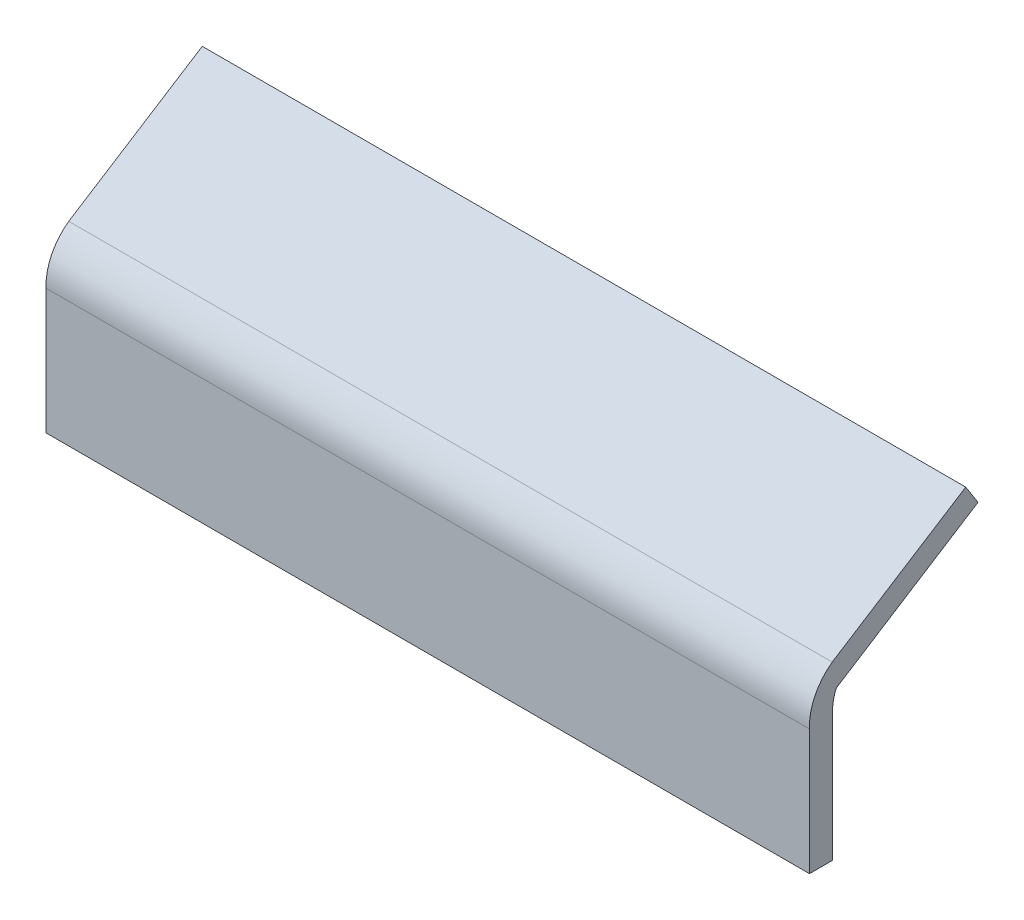
ISO-10303-21;
HEADER;
FILE_DESCRIPTION(('STEP AP214'),'2;1');
FILE_NAME('part.step','',(''),(''),'','','');
FILE_SCHEMA(('AUTOMOTIVE_DESIGN { 1 0 10303 214 1 1 1 1 }'));
ENDSEC;
DATA;
#1=APPLICATION_CONTEXT('core data for automotive mechanical design processes');
#2=APPLICATION_PROTOCOL_DEFINITION('international standard','automotive_design',2000,#1);
#3=PRODUCT_CONTEXT('',#1,'mechanical');
#4=PRODUCT('Part','Part','',(#3));
#5=PRODUCT_RELATED_PRODUCT_CATEGORY('part','',(#4));
#6=PRODUCT_DEFINITION_FORMATION('','',#4);
#7=PRODUCT_DEFINITION_CONTEXT('part definition',#1,'design');
#8=PRODUCT_DEFINITION('design','',#6,#7);
#9=PRODUCT_DEFINITION_SHAPE('','',#8);
#10=(LENGTH_UNIT() NAMED_UNIT(*) SI_UNIT(.MILLI.,.METRE.));
#11=(NAMED_UNIT(*) PLANE_ANGLE_UNIT() SI_UNIT($,.RADIAN.));
#12=(NAMED_UNIT(*) SI_UNIT($,.STERADIAN.) SOLID_ANGLE_UNIT());
#13=UNCERTAINTY_MEASURE_WITH_UNIT(LENGTH_MEASURE(1.E-05),#10,'distance_accuracy_value','');
#14=(GEOMETRIC_REPRESENTATION_CONTEXT(3) GLOBAL_UNCERTAINTY_ASSIGNED_CONTEXT((#13)) GLOBAL_UNIT_ASSIGNED_CONTEXT((#10,
#11,#12)) REPRESENTATION_CONTEXT('',''));
#15=CARTESIAN_POINT('',(0.,0.,0.));
#16=DIRECTION('',(0.,0.,1.));
#17=DIRECTION('',(1.,0.,0.));
#18=AXIS2_PLACEMENT_3D('',#15,#16,#17);
#19=CARTESIAN_POINT('',(-557.5,91.4999999999999,33.45));
#20=DIRECTION('',(1.,0.,0.));
#21=DIRECTION('',(0.,0.,-1.));
#22=AXIS2_PLACEMENT_3D('',#19,#20,#21);
#23=PLANE('',#22);
#24=DIRECTION('',(0.,-1.,0.));
#25=VECTOR('',#24,1.);
#26=CARTESIAN_POINT('',(-557.5,91.4999999999999,0.));
#27=LINE('',#26,#25);
#28=CARTESIAN_POINT('',(-557.5,91.4999999999999,0.));
#29=VERTEX_POINT('',#28);
#30=CARTESIAN_POINT('',(-557.5,-91.5000000000001,0.));
#31=VERTEX_POINT('',#30);
#32=EDGE_CURVE('E82',#29,#31,#27,.T.);
#33=ORIENTED_EDGE('',*,*,#32,.T.);
#34=DIRECTION('',(0.,0.,-1.));
#35=VECTOR('',#34,1.);
#36=CARTESIAN_POINT('',(-557.5,-91.5000000000001,33.45));
#37=LINE('',#36,#35);
#38=CARTESIAN_POINT('',(-557.5,-91.5000000000001,33.45));
#39=VERTEX_POINT('',#38);
#40=EDGE_CURVE('E11',#39,#31,#37,.T.);
#41=ORIENTED_EDGE('',*,*,#40,.F.);
#42=DIRECTION('',(0.,-1.,0.));
#43=VECTOR('',#42,1.);
#44=CARTESIAN_POINT('',(-557.5,91.4999999999999,33.45));
#45=LINE('',#44,#43);
#46=CARTESIAN_POINT('',(-557.5,91.4999999999999,33.45));
#47=VERTEX_POINT('',#46);
#48=EDGE_CURVE('E129',#47,#39,#45,.T.);
#49=ORIENTED_EDGE('',*,*,#48,.F.);
#50=CARTESIAN_POINT('',(-557.5,94.5798592345178,-46.4906934364192));
#51=DIRECTION('',(1.,0.,0.));
#52=DIRECTION('',(0.,0.,-1.));
#53=AXIS2_PLACEMENT_3D('',#50,#51,#52);
#54=CIRCLE('',#53,80.);
#55=CARTESIAN_POINT('',(-557.5,159.515154012161,0.236252666879662));
#56=VERTEX_POINT('',#55);
#57=EDGE_CURVE('E192',#47,#56,#54,.F.);
#58=ORIENTED_EDGE('',*,*,#57,.T.);
#59=DIRECTION('',(0.,0.535992900620415,-0.844222488734169));
#60=VECTOR('',#59,1.);
#61=CARTESIAN_POINT('',(-557.5,159.515154012161,0.236252666879662));
#62=LINE('',#61,#60);
#63=CARTESIAN_POINT('',(-557.5,283.329514055477,-194.779142230713));
#64=VERTEX_POINT('',#63);
#65=EDGE_CURVE('E197',#56,#64,#62,.T.);
#66=ORIENTED_EDGE('',*,*,#65,.T.);
#67=DIRECTION('',(0.,-0.844222488734169,-0.535992900620415));
#68=VECTOR('',#67,1.);
#69=CARTESIAN_POINT('',(-557.5,283.329514055477,-194.779142230713));
#70=LINE('',#69,#68);
#71=CARTESIAN_POINT('',(-557.5,255.090271807319,-212.708104756466));
#72=VERTEX_POINT('',#71);
#73=EDGE_CURVE('E199',#64,#72,#70,.T.);
#74=ORIENTED_EDGE('',*,*,#73,.T.);
#75=DIRECTION('',(0.,-0.535992900620415,0.844222488734169));
#76=VECTOR('',#75,1.);
#77=CARTESIAN_POINT('',(-557.5,125.251726765803,-8.20424005658895));
#78=LINE('',#77,#76);
#79=CARTESIAN_POINT('',(-557.5,125.251726765803,-8.20424005658896));
#80=VERTEX_POINT('',#79);
#81=EDGE_CURVE('E202',#72,#80,#78,.T.);
#82=ORIENTED_EDGE('',*,*,#81,.T.);
#83=CARTESIAN_POINT('',(-557.5,116.809501878461,-13.5641690627931));
#84=DIRECTION('',(1.,0.,0.));
#85=DIRECTION('',(0.,0.,-1.));
#86=AXIS2_PLACEMENT_3D('',#83,#84,#85);
#87=CIRCLE('',#86,9.99999999999999);
#88=CARTESIAN_POINT('',(-557.5,119.98516511331,-4.08180843798939));
#89=VERTEX_POINT('',#88);
#90=EDGE_CURVE('E205',#80,#89,#87,.T.);
#91=ORIENTED_EDGE('',*,*,#90,.T.);
#92=CARTESIAN_POINT('',(-557.5,94.5798592345178,-79.9406934364192));
#93=DIRECTION('',(1.,0.,0.));
#94=DIRECTION('',(0.,0.,-1.));
#95=AXIS2_PLACEMENT_3D('',#92,#93,#94);
#96=CIRCLE('',#95,80.);
#97=EDGE_CURVE('E169',#89,#29,#96,.T.);
#98=ORIENTED_EDGE('',*,*,#97,.T.);
#99=EDGE_LOOP('',(#33,#41,#49,#58,#66,#74,#82,#91,#98));
#100=FACE_BOUND('',#99,.T.);
#101=ADVANCED_FACE('F45',(#100),#23,.F.);
#102=CARTESIAN_POINT('',(557.5,-91.4999999999999,33.45));
#103=DIRECTION('',(0.,1.,0.));
#104=DIRECTION('',(-1.,0.,0.));
#105=AXIS2_PLACEMENT_3D('',#102,#103,#104);
#106=PLANE('',#105);
#107=DIRECTION('',(1.,0.,0.));
#108=VECTOR('',#107,1.);
#109=CARTESIAN_POINT('',(557.5,-91.4999999999999,0.));
#110=LINE('',#109,#108);
#111=CARTESIAN_POINT('',(557.5,-91.4999999999999,0.));
#112=VERTEX_POINT('',#111);
#113=EDGE_CURVE('E75',#31,#112,#110,.T.);
#114=ORIENTED_EDGE('',*,*,#113,.T.);
#115=DIRECTION('',(0.,0.,-1.));
#116=VECTOR('',#115,1.);
#117=CARTESIAN_POINT('',(557.5,-91.4999999999999,33.45));
#118=LINE('',#117,#116);
#119=CARTESIAN_POINT('',(557.5,-91.4999999999999,33.45));
#120=VERTEX_POINT('',#119);
#121=EDGE_CURVE('E54',#120,#112,#118,.T.);
#122=ORIENTED_EDGE('',*,*,#121,.F.);
#123=DIRECTION('',(1.,0.,0.));
#124=VECTOR('',#123,1.);
#125=CARTESIAN_POINT('',(557.5,-91.4999999999999,33.45));
#126=LINE('',#125,#124);
#127=EDGE_CURVE('E87',#39,#120,#126,.T.);
#128=ORIENTED_EDGE('',*,*,#127,.F.);
#129=ORIENTED_EDGE('',*,*,#40,.T.);
#130=EDGE_LOOP('',(#114,#122,#128,#129));
#131=FACE_BOUND('',#130,.T.);
#132=ADVANCED_FACE('F236',(#131),#106,.F.);
#133=CARTESIAN_POINT('',(557.5,91.5000000000001,33.45));
#134=DIRECTION('',(-1.,0.,0.));
#135=DIRECTION('',(0.,0.,1.));
#136=AXIS2_PLACEMENT_3D('',#133,#134,#135);
#137=PLANE('',#136);
#138=DIRECTION('',(0.,1.,0.));
#139=VECTOR('',#138,1.);
#140=CARTESIAN_POINT('',(557.5,91.5000000000001,0.));
#141=LINE('',#140,#139);
#142=CARTESIAN_POINT('',(557.5,91.5000000000001,0.));
#143=VERTEX_POINT('',#142);
#144=EDGE_CURVE('E124',#112,#143,#141,.T.);
#145=ORIENTED_EDGE('',*,*,#144,.T.);
#146=CARTESIAN_POINT('',(557.5,94.5798592345178,-79.9406934364192));
#147=DIRECTION('',(-1.,0.,0.));
#148=DIRECTION('',(0.,0.,1.));
#149=AXIS2_PLACEMENT_3D('',#146,#147,#148);
#150=CIRCLE('',#149,80.);
#151=CARTESIAN_POINT('',(557.5,119.98516511331,-4.0818084379894));
#152=VERTEX_POINT('',#151);
#153=EDGE_CURVE('E135',#143,#152,#150,.T.);
#154=ORIENTED_EDGE('',*,*,#153,.T.);
#155=CARTESIAN_POINT('',(557.5,116.809501878461,-13.5641690627931));
#156=DIRECTION('',(-1.,0.,0.));
#157=DIRECTION('',(0.,0.,-1.));
#158=AXIS2_PLACEMENT_3D('',#155,#156,#157);
#159=CIRCLE('',#158,9.99999999999999);
#160=CARTESIAN_POINT('',(557.5,125.251726765803,-8.20424005658895));
#161=VERTEX_POINT('',#160);
#162=EDGE_CURVE('E144',#152,#161,#159,.T.);
#163=ORIENTED_EDGE('',*,*,#162,.T.);
#164=DIRECTION('',(0.,0.535992900620415,-0.844222488734169));
#165=VECTOR('',#164,1.);
#166=CARTESIAN_POINT('',(557.5,125.251726765803,-8.20424005658895));
#167=LINE('',#166,#165);
#168=CARTESIAN_POINT('',(557.5,255.090271807319,-212.708104756466));
#169=VERTEX_POINT('',#168);
#170=EDGE_CURVE('E149',#161,#169,#167,.T.);
#171=ORIENTED_EDGE('',*,*,#170,.T.);
#172=DIRECTION('',(0.,0.844222488734169,0.535992900620415));
#173=VECTOR('',#172,1.);
#174=CARTESIAN_POINT('',(557.5,283.329514055477,-194.779142230713));
#175=LINE('',#174,#173);
#176=CARTESIAN_POINT('',(557.5,283.329514055477,-194.779142230713));
#177=VERTEX_POINT('',#176);
#178=EDGE_CURVE('E158',#169,#177,#175,.T.);
#179=ORIENTED_EDGE('',*,*,#178,.T.);
#180=DIRECTION('',(0.,-0.535992900620415,0.844222488734169));
#181=VECTOR('',#180,1.);
#182=CARTESIAN_POINT('',(557.5,159.515154012161,0.236252666879662));
#183=LINE('',#182,#181);
#184=CARTESIAN_POINT('',(557.5,159.515154012161,0.236252666879662));
#185=VERTEX_POINT('',#184);
#186=EDGE_CURVE('E162',#177,#185,#183,.T.);
#187=ORIENTED_EDGE('',*,*,#186,.T.);
#188=CARTESIAN_POINT('',(557.5,94.5798592345178,-46.4906934364192));
#189=DIRECTION('',(1.,0.,0.));
#190=DIRECTION('',(0.,0.,1.));
#191=AXIS2_PLACEMENT_3D('',#188,#189,#190);
#192=CIRCLE('',#191,80.);
#193=CARTESIAN_POINT('',(557.5,91.5000000000001,33.45));
#194=VERTEX_POINT('',#193);
#195=EDGE_CURVE('E145',#185,#194,#192,.T.);
#196=ORIENTED_EDGE('',*,*,#195,.T.);
#197=DIRECTION('',(0.,1.,0.));
#198=VECTOR('',#197,1.);
#199=CARTESIAN_POINT('',(557.5,91.5000000000001,33.45));
#200=LINE('',#199,#198);
#201=EDGE_CURVE('E185',#120,#194,#200,.T.);
#202=ORIENTED_EDGE('',*,*,#201,.F.);
#203=ORIENTED_EDGE('',*,*,#121,.T.);
#204=EDGE_LOOP('',(#145,#154,#163,#171,#179,#187,#196,#202,#203));
#205=FACE_BOUND('',#204,.T.);
#206=ADVANCED_FACE('F133',(#205),#137,.F.);
#207=CARTESIAN_POINT('',(0.,0.,33.45));
#208=DIRECTION('',(0.,0.,-1.));
#209=DIRECTION('',(-1.,0.,0.));
#210=AXIS2_PLACEMENT_3D('',#207,#208,#209);
#211=PLANE('',#210);
#212=ORIENTED_EDGE('',*,*,#48,.T.);
#213=ORIENTED_EDGE('',*,*,#127,.T.);
#214=ORIENTED_EDGE('',*,*,#201,.T.);
#215=DIRECTION('',(-1.,0.,0.));
#216=VECTOR('',#215,1.);
#217=CARTESIAN_POINT('',(557.5,91.5000000000001,33.45));
#218=LINE('',#217,#216);
#219=EDGE_CURVE('E62',#194,#47,#218,.T.);
#220=ORIENTED_EDGE('',*,*,#219,.T.);
#221=EDGE_LOOP('',(#212,#213,#214,#220));
#222=FACE_BOUND('',#221,.T.);
#223=ADVANCED_FACE('F235',(#222),#211,.F.);
#224=CARTESIAN_POINT('',(0.,0.,0.));
#225=DIRECTION('',(0.,0.,-1.));
#226=DIRECTION('',(-1.,0.,0.));
#227=AXIS2_PLACEMENT_3D('',#224,#225,#226);
#228=PLANE('',#227);
#229=ORIENTED_EDGE('',*,*,#32,.F.);
#230=DIRECTION('',(-1.,0.,0.));
#231=VECTOR('',#230,1.);
#232=CARTESIAN_POINT('',(557.5,91.5000000000001,0.));
#233=LINE('',#232,#231);
#234=EDGE_CURVE('E121',#143,#29,#233,.T.);
#235=ORIENTED_EDGE('',*,*,#234,.F.);
#236=ORIENTED_EDGE('',*,*,#144,.F.);
#237=ORIENTED_EDGE('',*,*,#113,.F.);
#238=EDGE_LOOP('',(#229,#235,#236,#237));
#239=FACE_BOUND('',#238,.T.);
#240=ADVANCED_FACE('F123',(#239),#228,.T.);
#241=CARTESIAN_POINT('',(-869.624295914153,94.5798592345178,-46.4906934364192));
#242=DIRECTION('',(1.,0.,0.));
#243=DIRECTION('',(0.,0.,-1.));
#244=AXIS2_PLACEMENT_3D('',#241,#242,#243);
#245=CYLINDRICAL_SURFACE('',#244,80.);
#246=ORIENTED_EDGE('',*,*,#57,.F.);
#247=ORIENTED_EDGE('',*,*,#219,.F.);
#248=ORIENTED_EDGE('',*,*,#195,.F.);
#249=DIRECTION('',(1.,0.,0.));
#250=VECTOR('',#249,1.);
#251=CARTESIAN_POINT('',(-869.624295914153,159.515154012161,0.236252666879662));
#252=LINE('',#251,#250);
#253=EDGE_CURVE('E166',#56,#185,#252,.T.);
#254=ORIENTED_EDGE('',*,*,#253,.F.);
#255=EDGE_LOOP('',(#246,#247,#248,#254));
#256=FACE_BOUND('',#255,.T.);
#257=ADVANCED_FACE('F234',(#256),#245,.T.);
#258=CARTESIAN_POINT('',(-869.624295914153,159.515154012161,0.236252666879662));
#259=DIRECTION('',(0.,0.844222488734169,0.535992900620415));
#260=DIRECTION('',(0.,-0.535992900620415,0.844222488734169));
#261=AXIS2_PLACEMENT_3D('',#258,#259,#260);
#262=PLANE('',#261);
#263=ORIENTED_EDGE('',*,*,#65,.F.);
#264=ORIENTED_EDGE('',*,*,#253,.T.);
#265=ORIENTED_EDGE('',*,*,#186,.F.);
#266=DIRECTION('',(1.,0.,0.));
#267=VECTOR('',#266,1.);
#268=CARTESIAN_POINT('',(-869.624295914153,283.329514055477,-194.779142230713));
#269=LINE('',#268,#267);
#270=EDGE_CURVE('E170',#64,#177,#269,.T.);
#271=ORIENTED_EDGE('',*,*,#270,.F.);
#272=EDGE_LOOP('',(#263,#264,#265,#271));
#273=FACE_BOUND('',#272,.T.);
#274=ADVANCED_FACE('F229',(#273),#262,.T.);
#275=CARTESIAN_POINT('',(-869.624295914153,283.329514055477,-194.779142230713));
#276=DIRECTION('',(0.,0.535992900620415,-0.844222488734169));
#277=DIRECTION('',(0.,0.844222488734169,0.535992900620415));
#278=AXIS2_PLACEMENT_3D('',#275,#276,#277);
#279=PLANE('',#278);
#280=ORIENTED_EDGE('',*,*,#73,.F.);
#281=ORIENTED_EDGE('',*,*,#270,.T.);
#282=ORIENTED_EDGE('',*,*,#178,.F.);
#283=DIRECTION('',(1.,0.,0.));
#284=VECTOR('',#283,1.);
#285=CARTESIAN_POINT('',(-869.624295914153,255.090271807319,-212.708104756466));
#286=LINE('',#285,#284);
#287=EDGE_CURVE('E173',#72,#169,#286,.T.);
#288=ORIENTED_EDGE('',*,*,#287,.F.);
#289=EDGE_LOOP('',(#280,#281,#282,#288));
#290=FACE_BOUND('',#289,.T.);
#291=ADVANCED_FACE('F225',(#290),#279,.T.);
#292=CARTESIAN_POINT('',(-869.624295914153,125.251726765803,-8.20424005658895));
#293=DIRECTION('',(0.,-0.844222488734169,-0.535992900620415));
#294=DIRECTION('',(0.,0.535992900620415,-0.844222488734169));
#295=AXIS2_PLACEMENT_3D('',#292,#293,#294);
#296=PLANE('',#295);
#297=ORIENTED_EDGE('',*,*,#81,.F.);
#298=ORIENTED_EDGE('',*,*,#287,.T.);
#299=ORIENTED_EDGE('',*,*,#170,.F.);
#300=DIRECTION('',(1.,0.,0.));
#301=VECTOR('',#300,1.);
#302=CARTESIAN_POINT('',(-869.624295914153,125.251726765803,-8.20424005658895));
#303=LINE('',#302,#301);
#304=EDGE_CURVE('E176',#80,#161,#303,.T.);
#305=ORIENTED_EDGE('',*,*,#304,.F.);
#306=EDGE_LOOP('',(#297,#298,#299,#305));
#307=FACE_BOUND('',#306,.T.);
#308=ADVANCED_FACE('F221',(#307),#296,.T.);
#309=CARTESIAN_POINT('',(-869.624295914153,116.809501878461,-13.5641690627931));
#310=DIRECTION('',(1.,0.,0.));
#311=DIRECTION('',(0.,0.,-1.));
#312=AXIS2_PLACEMENT_3D('',#309,#310,#311);
#313=CYLINDRICAL_SURFACE('',#312,9.99999999999999);
#314=ORIENTED_EDGE('',*,*,#90,.F.);
#315=ORIENTED_EDGE('',*,*,#304,.T.);
#316=ORIENTED_EDGE('',*,*,#162,.F.);
#317=DIRECTION('',(1.,0.,0.));
#318=VECTOR('',#317,1.);
#319=CARTESIAN_POINT('',(-869.624295914153,119.98516511331,-4.0818084379894));
#320=LINE('',#319,#318);
#321=EDGE_CURVE('E141',#89,#152,#320,.T.);
#322=ORIENTED_EDGE('',*,*,#321,.F.);
#323=EDGE_LOOP('',(#314,#315,#316,#322));
#324=FACE_BOUND('',#323,.T.);
#325=ADVANCED_FACE('F214',(#324),#313,.F.);
#326=CARTESIAN_POINT('',(-869.624295914153,94.5798592345178,-79.9406934364192));
#327=DIRECTION('',(1.,0.,0.));
#328=DIRECTION('',(0.,0.,-1.));
#329=AXIS2_PLACEMENT_3D('',#326,#327,#328);
#330=CYLINDRICAL_SURFACE('',#329,80.);
#331=ORIENTED_EDGE('',*,*,#97,.F.);
#332=ORIENTED_EDGE('',*,*,#321,.T.);
#333=ORIENTED_EDGE('',*,*,#153,.F.);
#334=ORIENTED_EDGE('',*,*,#234,.T.);
#335=EDGE_LOOP('',(#331,#332,#333,#334));
#336=FACE_BOUND('',#335,.T.);
#337=ADVANCED_FACE('F139',(#336),#330,.F.);
#338=CLOSED_SHELL('',(#101,#132,#206,#223,#240,#257,#274,#291,#308,#325,#337));
#339=MANIFOLD_SOLID_BREP('B2',#338);
#340=ADVANCED_BREP_SHAPE_REPRESENTATION('',(#18,#339),#14);
#341=SHAPE_DEFINITION_REPRESENTATION(#9,#340);
ENDSEC;
END-ISO-10303-21;
